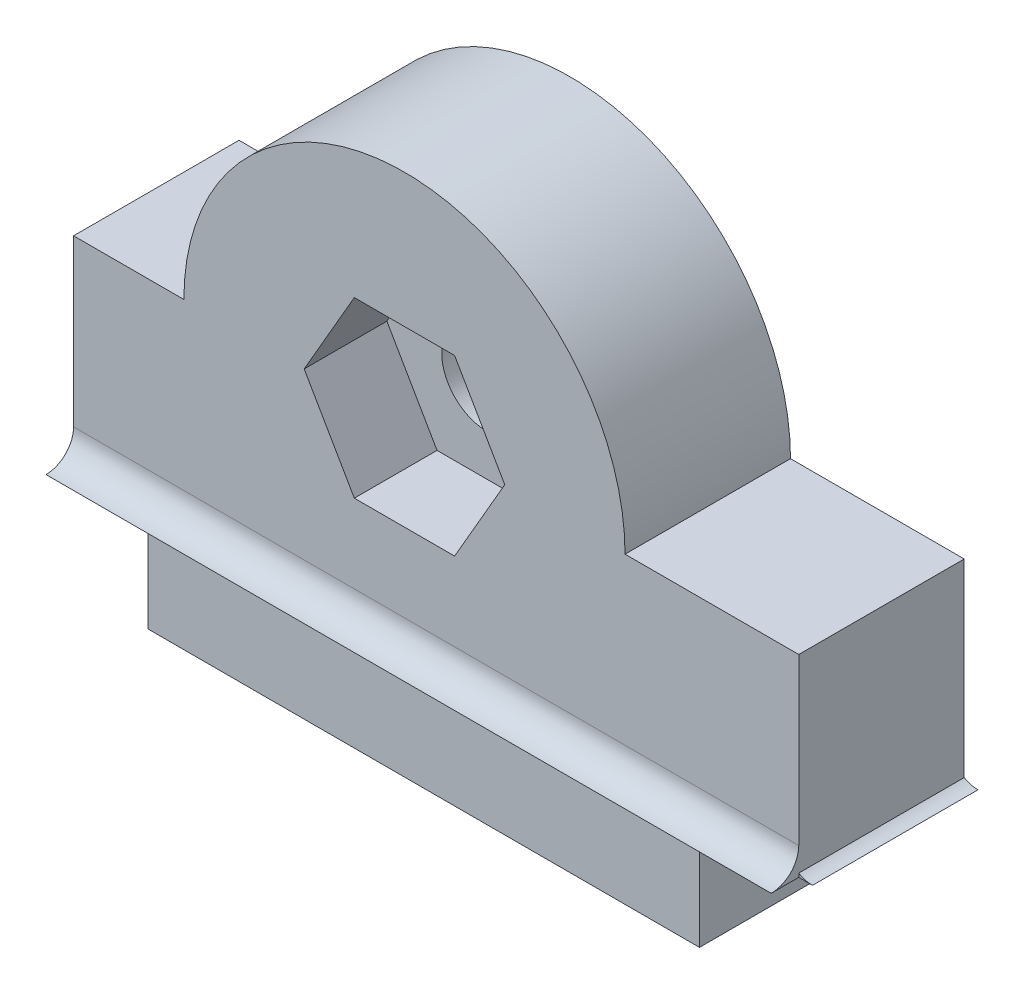
ISO-10303-21;
HEADER;
FILE_DESCRIPTION(('STEP AP214'),'2;1');
FILE_NAME('part.step','',(''),(''),'','','');
FILE_SCHEMA(('AUTOMOTIVE_DESIGN { 1 0 10303 214 1 1 1 1 }'));
ENDSEC;
DATA;
#1=APPLICATION_CONTEXT('core data for automotive mechanical design processes');
#2=APPLICATION_PROTOCOL_DEFINITION('international standard','automotive_design',2000,#1);
#3=PRODUCT_CONTEXT('',#1,'mechanical');
#4=PRODUCT('Part','Part','',(#3));
#5=PRODUCT_RELATED_PRODUCT_CATEGORY('part','',(#4));
#6=PRODUCT_DEFINITION_FORMATION('','',#4);
#7=PRODUCT_DEFINITION_CONTEXT('part definition',#1,'design');
#8=PRODUCT_DEFINITION('design','',#6,#7);
#9=PRODUCT_DEFINITION_SHAPE('','',#8);
#10=(LENGTH_UNIT() NAMED_UNIT(*) SI_UNIT(.MILLI.,.METRE.));
#11=(NAMED_UNIT(*) PLANE_ANGLE_UNIT() SI_UNIT($,.RADIAN.));
#12=(NAMED_UNIT(*) SI_UNIT($,.STERADIAN.) SOLID_ANGLE_UNIT());
#13=UNCERTAINTY_MEASURE_WITH_UNIT(LENGTH_MEASURE(1.E-05),#10,'distance_accuracy_value','');
#14=(GEOMETRIC_REPRESENTATION_CONTEXT(3) GLOBAL_UNCERTAINTY_ASSIGNED_CONTEXT((#13)) GLOBAL_UNIT_ASSIGNED_CONTEXT((#10,
#11,#12)) REPRESENTATION_CONTEXT('',''));
#15=CARTESIAN_POINT('',(0.,0.,0.));
#16=DIRECTION('',(0.,0.,1.));
#17=DIRECTION('',(1.,0.,0.));
#18=AXIS2_PLACEMENT_3D('',#15,#16,#17);
#19=CARTESIAN_POINT('',(9.29999999999998,11.,6.));
#20=DIRECTION('',(0.,0.,1.));
#21=DIRECTION('',(1.,0.,0.));
#22=AXIS2_PLACEMENT_3D('',#19,#20,#21);
#23=PLANE('',#22);
#24=DIRECTION('',(-1.,0.,0.));
#25=VECTOR('',#24,1.);
#26=CARTESIAN_POINT('',(11.1186533479473,14.15,6.));
#27=LINE('',#26,#25);
#28=CARTESIAN_POINT('',(11.1186533479473,14.15,6.));
#29=VERTEX_POINT('',#28);
#30=CARTESIAN_POINT('',(7.48134665205268,14.15,6.));
#31=VERTEX_POINT('',#30);
#32=EDGE_CURVE('E237',#29,#31,#27,.T.);
#33=ORIENTED_EDGE('',*,*,#32,.F.);
#34=DIRECTION('',(-0.5,0.866025403784439,0.));
#35=VECTOR('',#34,1.);
#36=CARTESIAN_POINT('',(12.9373066958946,11.,6.));
#37=LINE('',#36,#35);
#38=CARTESIAN_POINT('',(12.9373066958946,11.,6.));
#39=VERTEX_POINT('',#38);
#40=EDGE_CURVE('E235',#39,#29,#37,.T.);
#41=ORIENTED_EDGE('',*,*,#40,.F.);
#42=DIRECTION('',(0.5,0.866025403784439,0.));
#43=VECTOR('',#42,1.);
#44=CARTESIAN_POINT('',(11.1186533479473,7.85000000000001,6.));
#45=LINE('',#44,#43);
#46=CARTESIAN_POINT('',(11.1186533479473,7.85000000000001,6.));
#47=VERTEX_POINT('',#46);
#48=EDGE_CURVE('E181',#47,#39,#45,.T.);
#49=ORIENTED_EDGE('',*,*,#48,.F.);
#50=DIRECTION('',(1.,0.,0.));
#51=VECTOR('',#50,1.);
#52=CARTESIAN_POINT('',(7.48134665205267,7.85000000000002,6.));
#53=LINE('',#52,#51);
#54=CARTESIAN_POINT('',(7.48134665205267,7.85000000000002,6.));
#55=VERTEX_POINT('',#54);
#56=EDGE_CURVE('E243',#55,#47,#53,.T.);
#57=ORIENTED_EDGE('',*,*,#56,.F.);
#58=DIRECTION('',(0.5,-0.866025403784439,0.));
#59=VECTOR('',#58,1.);
#60=CARTESIAN_POINT('',(5.66269330410536,11.,6.));
#61=LINE('',#60,#59);
#62=CARTESIAN_POINT('',(5.66269330410536,11.,6.));
#63=VERTEX_POINT('',#62);
#64=EDGE_CURVE('E241',#63,#55,#61,.T.);
#65=ORIENTED_EDGE('',*,*,#64,.F.);
#66=DIRECTION('',(-0.5,-0.866025403784439,0.));
#67=VECTOR('',#66,1.);
#68=CARTESIAN_POINT('',(7.48134665205268,14.15,6.));
#69=LINE('',#68,#67);
#70=EDGE_CURVE('E239',#31,#63,#69,.T.);
#71=ORIENTED_EDGE('',*,*,#70,.F.);
#72=EDGE_LOOP('',(#33,#41,#49,#57,#65,#71));
#73=FACE_BOUND('',#72,.T.);
#74=DIRECTION('',(0.,-1.,0.));
#75=VECTOR('',#74,1.);
#76=CARTESIAN_POINT('',(-2.7,4.,6.));
#77=LINE('',#76,#75);
#78=CARTESIAN_POINT('',(-2.7,11.,6.));
#79=VERTEX_POINT('',#78);
#80=CARTESIAN_POINT('',(-2.7,5.,6.));
#81=VERTEX_POINT('',#80);
#82=EDGE_CURVE('E273',#79,#81,#77,.T.);
#83=ORIENTED_EDGE('',*,*,#82,.T.);
#84=DIRECTION('',(-1.,0.,0.));
#85=VECTOR('',#84,1.);
#86=CARTESIAN_POINT('',(25.0142135623731,5.,6.));
#87=LINE('',#86,#85);
#88=CARTESIAN_POINT('',(-1.49999999999999,5.,6.));
#89=VERTEX_POINT('',#88);
#90=EDGE_CURVE('E230',#89,#81,#87,.T.);
#91=ORIENTED_EDGE('',*,*,#90,.F.);
#92=CARTESIAN_POINT('',(23.1,5.,6.));
#93=VERTEX_POINT('',#92);
#94=EDGE_CURVE('E229',#93,#89,#87,.T.);
#95=ORIENTED_EDGE('',*,*,#94,.F.);
#96=CARTESIAN_POINT('',(23.6,5.,6.));
#97=VERTEX_POINT('',#96);
#98=EDGE_CURVE('E226',#97,#93,#87,.T.);
#99=ORIENTED_EDGE('',*,*,#98,.F.);
#100=DIRECTION('',(0.,1.,0.));
#101=VECTOR('',#100,1.);
#102=CARTESIAN_POINT('',(23.6,11.,6.));
#103=LINE('',#102,#101);
#104=CARTESIAN_POINT('',(23.6,11.,6.));
#105=VERTEX_POINT('',#104);
#106=EDGE_CURVE('E265',#97,#105,#103,.T.);
#107=ORIENTED_EDGE('',*,*,#106,.T.);
#108=DIRECTION('',(-1.,0.,0.));
#109=VECTOR('',#108,1.);
#110=CARTESIAN_POINT('',(17.3,11.,6.));
#111=LINE('',#110,#109);
#112=CARTESIAN_POINT('',(17.3,11.,6.));
#113=VERTEX_POINT('',#112);
#114=EDGE_CURVE('E267',#105,#113,#111,.T.);
#115=ORIENTED_EDGE('',*,*,#114,.T.);
#116=CARTESIAN_POINT('',(9.29999999999998,11.,6.));
#117=DIRECTION('',(0.,0.,1.));
#118=DIRECTION('',(1.,0.,0.));
#119=AXIS2_PLACEMENT_3D('',#116,#117,#118);
#120=CIRCLE('',#119,8.00000000000001);
#121=CARTESIAN_POINT('',(1.29999999999998,11.,6.));
#122=VERTEX_POINT('',#121);
#123=EDGE_CURVE('E269',#113,#122,#120,.T.);
#124=ORIENTED_EDGE('',*,*,#123,.T.);
#125=DIRECTION('',(-1.,0.,0.));
#126=VECTOR('',#125,1.);
#127=CARTESIAN_POINT('',(-2.7,11.,6.));
#128=LINE('',#127,#126);
#129=EDGE_CURVE('E271',#122,#79,#128,.T.);
#130=ORIENTED_EDGE('',*,*,#129,.T.);
#131=EDGE_LOOP('',(#83,#91,#95,#99,#107,#115,#124,#130));
#132=FACE_BOUND('',#131,.T.);
#133=ADVANCED_FACE('F35',(#73,#132),#23,.T.);
#134=DIRECTION('',(-1.,0.,0.));
#135=VECTOR('',#134,1.);
#136=CARTESIAN_POINT('',(25.0142135623731,4.,6.));
#137=LINE('',#136,#135);
#138=CARTESIAN_POINT('',(20.,4.,6.));
#139=VERTEX_POINT('',#138);
#140=CARTESIAN_POINT('',(0.,4.,6.));
#141=VERTEX_POINT('',#140);
#142=EDGE_CURVE('E222',#139,#141,#137,.T.);
#143=ORIENTED_EDGE('',*,*,#142,.T.);
#144=DIRECTION('',(0.,-1.,0.));
#145=VECTOR('',#144,1.);
#146=CARTESIAN_POINT('',(0.,0.,6.));
#147=LINE('',#146,#145);
#148=CARTESIAN_POINT('',(0.,0.,6.));
#149=VERTEX_POINT('',#148);
#150=EDGE_CURVE('E257',#141,#149,#147,.T.);
#151=ORIENTED_EDGE('',*,*,#150,.T.);
#152=DIRECTION('',(1.,0.,0.));
#153=VECTOR('',#152,1.);
#154=CARTESIAN_POINT('',(0.,0.,6.));
#155=LINE('',#154,#153);
#156=CARTESIAN_POINT('',(20.,0.,6.));
#157=VERTEX_POINT('',#156);
#158=EDGE_CURVE('E260',#149,#157,#155,.T.);
#159=ORIENTED_EDGE('',*,*,#158,.T.);
#160=DIRECTION('',(0.,1.,0.));
#161=VECTOR('',#160,1.);
#162=CARTESIAN_POINT('',(20.,0.,6.));
#163=LINE('',#162,#161);
#164=EDGE_CURVE('E263',#157,#139,#163,.T.);
#165=ORIENTED_EDGE('',*,*,#164,.T.);
#166=EDGE_LOOP('',(#143,#151,#159,#165));
#167=FACE_BOUND('',#166,.T.);
#168=ADVANCED_FACE('F339',(#167),#23,.T.);
#169=CARTESIAN_POINT('',(9.29999999999998,11.,0.));
#170=DIRECTION('',(0.,0.,1.));
#171=DIRECTION('',(1.,0.,0.));
#172=AXIS2_PLACEMENT_3D('',#169,#170,#171);
#173=PLANE('',#172);
#174=DIRECTION('',(0.,-1.,0.));
#175=VECTOR('',#174,1.);
#176=CARTESIAN_POINT('',(0.,0.,0.));
#177=LINE('',#176,#175);
#178=CARTESIAN_POINT('',(0.,4.,0.));
#179=VERTEX_POINT('',#178);
#180=CARTESIAN_POINT('',(0.,0.,0.));
#181=VERTEX_POINT('',#180);
#182=EDGE_CURVE('E256',#179,#181,#177,.T.);
#183=ORIENTED_EDGE('',*,*,#182,.F.);
#184=DIRECTION('',(1.,0.,0.));
#185=VECTOR('',#184,1.);
#186=CARTESIAN_POINT('',(0.,4.,0.));
#187=LINE('',#186,#185);
#188=CARTESIAN_POINT('',(-2.7,4.,0.));
#189=VERTEX_POINT('',#188);
#190=EDGE_CURVE('E261',#189,#179,#187,.T.);
#191=ORIENTED_EDGE('',*,*,#190,.F.);
#192=DIRECTION('',(0.,-1.,0.));
#193=VECTOR('',#192,1.);
#194=CARTESIAN_POINT('',(-2.7,4.,0.));
#195=LINE('',#194,#193);
#196=CARTESIAN_POINT('',(-2.7,11.,0.));
#197=VERTEX_POINT('',#196);
#198=EDGE_CURVE('E293',#197,#189,#195,.T.);
#199=ORIENTED_EDGE('',*,*,#198,.F.);
#200=DIRECTION('',(-1.,0.,0.));
#201=VECTOR('',#200,1.);
#202=CARTESIAN_POINT('',(-2.7,11.,0.));
#203=LINE('',#202,#201);
#204=CARTESIAN_POINT('',(1.29999999999998,11.,0.));
#205=VERTEX_POINT('',#204);
#206=EDGE_CURVE('E291',#205,#197,#203,.T.);
#207=ORIENTED_EDGE('',*,*,#206,.F.);
#208=CARTESIAN_POINT('',(9.29999999999998,11.,0.));
#209=DIRECTION('',(0.,0.,1.));
#210=DIRECTION('',(1.,0.,0.));
#211=AXIS2_PLACEMENT_3D('',#208,#209,#210);
#212=CIRCLE('',#211,8.00000000000001);
#213=CARTESIAN_POINT('',(17.3,11.,0.));
#214=VERTEX_POINT('',#213);
#215=EDGE_CURVE('E289',#214,#205,#212,.T.);
#216=ORIENTED_EDGE('',*,*,#215,.F.);
#217=DIRECTION('',(-1.,0.,0.));
#218=VECTOR('',#217,1.);
#219=CARTESIAN_POINT('',(17.3,11.,0.));
#220=LINE('',#219,#218);
#221=CARTESIAN_POINT('',(23.6,11.,0.));
#222=VERTEX_POINT('',#221);
#223=EDGE_CURVE('E287',#222,#214,#220,.T.);
#224=ORIENTED_EDGE('',*,*,#223,.F.);
#225=DIRECTION('',(0.,1.,0.));
#226=VECTOR('',#225,1.);
#227=CARTESIAN_POINT('',(23.6,11.,0.));
#228=LINE('',#227,#226);
#229=CARTESIAN_POINT('',(23.6,4.13397459621556,0.));
#230=VERTEX_POINT('',#229);
#231=EDGE_CURVE('E285',#230,#222,#228,.T.);
#232=ORIENTED_EDGE('',*,*,#231,.F.);
#233=CARTESIAN_POINT('',(24.1,5.,0.));
#234=DIRECTION('',(0.,0.,1.));
#235=DIRECTION('',(1.,0.,0.));
#236=AXIS2_PLACEMENT_3D('',#233,#234,#235);
#237=CIRCLE('',#236,1.);
#238=CARTESIAN_POINT('',(24.1,4.,0.));
#239=VERTEX_POINT('',#238);
#240=EDGE_CURVE('E210',#230,#239,#237,.T.);
#241=ORIENTED_EDGE('',*,*,#240,.T.);
#242=DIRECTION('',(1.,0.,0.));
#243=VECTOR('',#242,1.);
#244=CARTESIAN_POINT('',(23.6,4.,0.));
#245=LINE('',#244,#243);
#246=CARTESIAN_POINT('',(20.,4.,0.));
#247=VERTEX_POINT('',#246);
#248=EDGE_CURVE('E283',#247,#239,#245,.T.);
#249=ORIENTED_EDGE('',*,*,#248,.F.);
#250=DIRECTION('',(0.,1.,0.));
#251=VECTOR('',#250,1.);
#252=CARTESIAN_POINT('',(20.,0.,0.));
#253=LINE('',#252,#251);
#254=CARTESIAN_POINT('',(20.,0.,0.));
#255=VERTEX_POINT('',#254);
#256=EDGE_CURVE('E281',#255,#247,#253,.T.);
#257=ORIENTED_EDGE('',*,*,#256,.F.);
#258=DIRECTION('',(1.,0.,0.));
#259=VECTOR('',#258,1.);
#260=CARTESIAN_POINT('',(0.,0.,0.));
#261=LINE('',#260,#259);
#262=EDGE_CURVE('E279',#181,#255,#261,.T.);
#263=ORIENTED_EDGE('',*,*,#262,.F.);
#264=EDGE_LOOP('',(#183,#191,#199,#207,#216,#224,#232,#241,#249,#257,#263));
#265=FACE_BOUND('',#264,.T.);
#266=CARTESIAN_POINT('',(9.29999999999998,11.,0.));
#267=DIRECTION('',(0.,0.,1.));
#268=DIRECTION('',(1.,0.,0.));
#269=AXIS2_PLACEMENT_3D('',#266,#267,#268);
#270=CIRCLE('',#269,1.65);
#271=CARTESIAN_POINT('',(10.95,11.,0.));
#272=VERTEX_POINT('',#271);
#273=EDGE_CURVE('E596',#272,#272,#270,.T.);
#274=ORIENTED_EDGE('',*,*,#273,.T.);
#275=EDGE_LOOP('',(#274));
#276=FACE_BOUND('',#275,.T.);
#277=ADVANCED_FACE('F328',(#265,#276),#173,.F.);
#278=CARTESIAN_POINT('',(0.,0.,6.));
#279=DIRECTION('',(1.,0.,0.));
#280=DIRECTION('',(0.,0.,-1.));
#281=AXIS2_PLACEMENT_3D('',#278,#279,#280);
#282=PLANE('',#281);
#283=ORIENTED_EDGE('',*,*,#182,.T.);
#284=DIRECTION('',(0.,0.,-1.));
#285=VECTOR('',#284,1.);
#286=CARTESIAN_POINT('',(0.,0.,6.));
#287=LINE('',#286,#285);
#288=EDGE_CURVE('E11',#149,#181,#287,.T.);
#289=ORIENTED_EDGE('',*,*,#288,.F.);
#290=ORIENTED_EDGE('',*,*,#150,.F.);
#291=DIRECTION('',(0.,0.,-1.));
#292=VECTOR('',#291,1.);
#293=CARTESIAN_POINT('',(0.,4.,6.));
#294=LINE('',#293,#292);
#295=EDGE_CURVE('E276',#141,#179,#294,.T.);
#296=ORIENTED_EDGE('',*,*,#295,.T.);
#297=EDGE_LOOP('',(#283,#289,#290,#296));
#298=FACE_BOUND('',#297,.T.);
#299=ADVANCED_FACE('F37',(#298),#282,.F.);
#300=CARTESIAN_POINT('',(0.,0.,6.));
#301=DIRECTION('',(0.,1.,0.));
#302=DIRECTION('',(0.,0.,1.));
#303=AXIS2_PLACEMENT_3D('',#300,#301,#302);
#304=PLANE('',#303);
#305=ORIENTED_EDGE('',*,*,#262,.T.);
#306=DIRECTION('',(0.,0.,-1.));
#307=VECTOR('',#306,1.);
#308=CARTESIAN_POINT('',(20.,0.,6.));
#309=LINE('',#308,#307);
#310=EDGE_CURVE('E43',#157,#255,#309,.T.);
#311=ORIENTED_EDGE('',*,*,#310,.F.);
#312=ORIENTED_EDGE('',*,*,#158,.F.);
#313=ORIENTED_EDGE('',*,*,#288,.T.);
#314=EDGE_LOOP('',(#305,#311,#312,#313));
#315=FACE_BOUND('',#314,.T.);
#316=ADVANCED_FACE('F341',(#315),#304,.F.);
#317=CARTESIAN_POINT('',(20.,0.,6.));
#318=DIRECTION('',(-1.,0.,0.));
#319=DIRECTION('',(0.,0.,1.));
#320=AXIS2_PLACEMENT_3D('',#317,#318,#319);
#321=PLANE('',#320);
#322=ORIENTED_EDGE('',*,*,#256,.T.);
#323=DIRECTION('',(0.,0.,-1.));
#324=VECTOR('',#323,1.);
#325=CARTESIAN_POINT('',(20.,4.,6.));
#326=LINE('',#325,#324);
#327=EDGE_CURVE('E315',#139,#247,#326,.T.);
#328=ORIENTED_EDGE('',*,*,#327,.F.);
#329=ORIENTED_EDGE('',*,*,#164,.F.);
#330=ORIENTED_EDGE('',*,*,#310,.T.);
#331=EDGE_LOOP('',(#322,#328,#329,#330));
#332=FACE_BOUND('',#331,.T.);
#333=ADVANCED_FACE('F322',(#332),#321,.F.);
#334=CARTESIAN_POINT('',(23.6,11.,6.));
#335=DIRECTION('',(-1.,0.,0.));
#336=DIRECTION('',(0.,-1.,0.));
#337=AXIS2_PLACEMENT_3D('',#334,#335,#336);
#338=PLANE('',#337);
#339=DIRECTION('',(0.,1.,0.));
#340=VECTOR('',#339,1.);
#341=CARTESIAN_POINT('',(23.6,11.,6.));
#342=LINE('',#341,#340);
#343=CARTESIAN_POINT('',(23.6,4.,6.));
#344=VERTEX_POINT('',#343);
#345=CARTESIAN_POINT('',(23.6,4.13397459621556,6.));
#346=VERTEX_POINT('',#345);
#347=EDGE_CURVE('E213',#344,#346,#342,.T.);
#348=ORIENTED_EDGE('',*,*,#347,.T.);
#349=DIRECTION('',(0.,0.,1.));
#350=VECTOR('',#349,1.);
#351=CARTESIAN_POINT('',(23.6,4.13397459621556,-1.4142135623731));
#352=LINE('',#351,#350);
#353=EDGE_CURVE('E215',#346,#230,#352,.F.);
#354=ORIENTED_EDGE('',*,*,#353,.T.);
#355=ORIENTED_EDGE('',*,*,#231,.T.);
#356=DIRECTION('',(0.,0.,-1.));
#357=VECTOR('',#356,1.);
#358=CARTESIAN_POINT('',(23.6,11.,6.));
#359=LINE('',#358,#357);
#360=EDGE_CURVE('E310',#105,#222,#359,.T.);
#361=ORIENTED_EDGE('',*,*,#360,.F.);
#362=ORIENTED_EDGE('',*,*,#106,.F.);
#363=CARTESIAN_POINT('',(23.6,5.,7.));
#364=DIRECTION('',(-1.,0.,0.));
#365=DIRECTION('',(0.,-1.,0.));
#366=AXIS2_PLACEMENT_3D('',#363,#364,#365);
#367=CIRCLE('',#366,1.);
#368=CARTESIAN_POINT('',(23.6,4.,7.));
#369=VERTEX_POINT('',#368);
#370=EDGE_CURVE('E225',#97,#369,#367,.T.);
#371=ORIENTED_EDGE('',*,*,#370,.T.);
#372=DIRECTION('',(0.,0.,-1.));
#373=VECTOR('',#372,1.);
#374=CARTESIAN_POINT('',(23.6,4.,6.));
#375=LINE('',#374,#373);
#376=EDGE_CURVE('E313',#369,#344,#375,.T.);
#377=ORIENTED_EDGE('',*,*,#376,.T.);
#378=EDGE_LOOP('',(#348,#354,#355,#361,#362,#371,#377));
#379=FACE_BOUND('',#378,.T.);
#380=ADVANCED_FACE('F368',(#379),#338,.F.);
#381=CARTESIAN_POINT('',(17.3,11.,6.));
#382=DIRECTION('',(0.,-1.,0.));
#383=DIRECTION('',(0.,0.,-1.));
#384=AXIS2_PLACEMENT_3D('',#381,#382,#383);
#385=PLANE('',#384);
#386=ORIENTED_EDGE('',*,*,#223,.T.);
#387=DIRECTION('',(0.,0.,-1.));
#388=VECTOR('',#387,1.);
#389=CARTESIAN_POINT('',(17.3,11.,6.));
#390=LINE('',#389,#388);
#391=EDGE_CURVE('E307',#113,#214,#390,.T.);
#392=ORIENTED_EDGE('',*,*,#391,.F.);
#393=ORIENTED_EDGE('',*,*,#114,.F.);
#394=ORIENTED_EDGE('',*,*,#360,.T.);
#395=EDGE_LOOP('',(#386,#392,#393,#394));
#396=FACE_BOUND('',#395,.T.);
#397=ADVANCED_FACE('F364',(#396),#385,.F.);
#398=CARTESIAN_POINT('',(9.29999999999998,11.,6.));
#399=DIRECTION('',(0.,0.,-1.));
#400=DIRECTION('',(-1.,0.,0.));
#401=AXIS2_PLACEMENT_3D('',#398,#399,#400);
#402=CYLINDRICAL_SURFACE('',#401,8.00000000000001);
#403=ORIENTED_EDGE('',*,*,#215,.T.);
#404=DIRECTION('',(0.,0.,-1.));
#405=VECTOR('',#404,1.);
#406=CARTESIAN_POINT('',(1.29999999999998,11.,6.));
#407=LINE('',#406,#405);
#408=EDGE_CURVE('E304',#122,#205,#407,.T.);
#409=ORIENTED_EDGE('',*,*,#408,.F.);
#410=ORIENTED_EDGE('',*,*,#123,.F.);
#411=ORIENTED_EDGE('',*,*,#391,.T.);
#412=EDGE_LOOP('',(#403,#409,#410,#411));
#413=FACE_BOUND('',#412,.T.);
#414=ADVANCED_FACE('F359',(#413),#402,.T.);
#415=CARTESIAN_POINT('',(-2.7,11.,6.));
#416=DIRECTION('',(0.,-1.,0.));
#417=DIRECTION('',(0.,0.,-1.));
#418=AXIS2_PLACEMENT_3D('',#415,#416,#417);
#419=PLANE('',#418);
#420=ORIENTED_EDGE('',*,*,#206,.T.);
#421=DIRECTION('',(0.,0.,-1.));
#422=VECTOR('',#421,1.);
#423=CARTESIAN_POINT('',(-2.7,11.,6.));
#424=LINE('',#423,#422);
#425=EDGE_CURVE('E301',#79,#197,#424,.T.);
#426=ORIENTED_EDGE('',*,*,#425,.F.);
#427=ORIENTED_EDGE('',*,*,#129,.F.);
#428=ORIENTED_EDGE('',*,*,#408,.T.);
#429=EDGE_LOOP('',(#420,#426,#427,#428));
#430=FACE_BOUND('',#429,.T.);
#431=ADVANCED_FACE('F354',(#430),#419,.F.);
#432=CARTESIAN_POINT('',(-2.7,4.,6.));
#433=DIRECTION('',(1.,0.,0.));
#434=DIRECTION('',(0.,1.,0.));
#435=AXIS2_PLACEMENT_3D('',#432,#433,#434);
#436=PLANE('',#435);
#437=ORIENTED_EDGE('',*,*,#198,.T.);
#438=DIRECTION('',(0.,0.,-1.));
#439=VECTOR('',#438,1.);
#440=CARTESIAN_POINT('',(-2.7,4.,6.));
#441=LINE('',#440,#439);
#442=CARTESIAN_POINT('',(-2.7,4.,7.));
#443=VERTEX_POINT('',#442);
#444=EDGE_CURVE('E298',#443,#189,#441,.T.);
#445=ORIENTED_EDGE('',*,*,#444,.F.);
#446=CARTESIAN_POINT('',(-2.7,5.,7.));
#447=DIRECTION('',(1.,0.,0.));
#448=DIRECTION('',(0.,0.,1.));
#449=AXIS2_PLACEMENT_3D('',#446,#447,#448);
#450=CIRCLE('',#449,1.);
#451=EDGE_CURVE('E218',#443,#81,#450,.T.);
#452=ORIENTED_EDGE('',*,*,#451,.T.);
#453=ORIENTED_EDGE('',*,*,#82,.F.);
#454=ORIENTED_EDGE('',*,*,#425,.T.);
#455=EDGE_LOOP('',(#437,#445,#452,#453,#454));
#456=FACE_BOUND('',#455,.T.);
#457=ADVANCED_FACE('F349',(#456),#436,.F.);
#458=CARTESIAN_POINT('',(0.,4.,6.));
#459=DIRECTION('',(0.,1.,0.));
#460=DIRECTION('',(0.,0.,1.));
#461=AXIS2_PLACEMENT_3D('',#458,#459,#460);
#462=PLANE('',#461);
#463=ORIENTED_EDGE('',*,*,#190,.T.);
#464=ORIENTED_EDGE('',*,*,#295,.F.);
#465=ORIENTED_EDGE('',*,*,#142,.F.);
#466=ORIENTED_EDGE('',*,*,#327,.T.);
#467=ORIENTED_EDGE('',*,*,#248,.T.);
#468=DIRECTION('',(0.,0.,1.));
#469=VECTOR('',#468,1.);
#470=CARTESIAN_POINT('',(24.1,4.,-1.4142135623731));
#471=LINE('',#470,#469);
#472=CARTESIAN_POINT('',(24.1,4.,6.));
#473=VERTEX_POINT('',#472);
#474=EDGE_CURVE('E207',#239,#473,#471,.T.);
#475=ORIENTED_EDGE('',*,*,#474,.T.);
#476=DIRECTION('',(1.,0.,0.));
#477=VECTOR('',#476,1.);
#478=CARTESIAN_POINT('',(23.1,4.,6.));
#479=LINE('',#478,#477);
#480=EDGE_CURVE('E191',#344,#473,#479,.T.);
#481=ORIENTED_EDGE('',*,*,#480,.F.);
#482=ORIENTED_EDGE('',*,*,#376,.F.);
#483=DIRECTION('',(-1.,0.,0.));
#484=VECTOR('',#483,1.);
#485=CARTESIAN_POINT('',(25.0142135623731,4.,7.));
#486=LINE('',#485,#484);
#487=EDGE_CURVE('E221',#369,#443,#486,.T.);
#488=ORIENTED_EDGE('',*,*,#487,.T.);
#489=ORIENTED_EDGE('',*,*,#444,.T.);
#490=EDGE_LOOP('',(#463,#464,#465,#466,#467,#475,#481,#482,#488,#489));
#491=FACE_BOUND('',#490,.T.);
#492=ADVANCED_FACE('F333',(#491),#462,.F.);
#493=CARTESIAN_POINT('',(12.9373066958946,11.,6.));
#494=DIRECTION('',(-0.866025403784439,-0.5,0.));
#495=DIRECTION('',(0.5,-0.866025403784439,0.));
#496=AXIS2_PLACEMENT_3D('',#493,#494,#495);
#497=PLANE('',#496);
#498=DIRECTION('',(-0.5,0.866025403784439,0.));
#499=VECTOR('',#498,1.);
#500=CARTESIAN_POINT('',(12.9373066958946,11.,3.));
#501=LINE('',#500,#499);
#502=CARTESIAN_POINT('',(12.9373066958946,11.,3.));
#503=VERTEX_POINT('',#502);
#504=CARTESIAN_POINT('',(11.1186533479473,14.15,3.));
#505=VERTEX_POINT('',#504);
#506=EDGE_CURVE('E187',#503,#505,#501,.T.);
#507=ORIENTED_EDGE('',*,*,#506,.F.);
#508=DIRECTION('',(0.,0.,-1.));
#509=VECTOR('',#508,1.);
#510=CARTESIAN_POINT('',(12.9373066958946,11.,6.));
#511=LINE('',#510,#509);
#512=EDGE_CURVE('E174',#39,#503,#511,.T.);
#513=ORIENTED_EDGE('',*,*,#512,.F.);
#514=ORIENTED_EDGE('',*,*,#40,.T.);
#515=DIRECTION('',(0.,0.,-1.));
#516=VECTOR('',#515,1.);
#517=CARTESIAN_POINT('',(11.1186533479473,14.15,6.));
#518=LINE('',#517,#516);
#519=EDGE_CURVE('E189',#29,#505,#518,.T.);
#520=ORIENTED_EDGE('',*,*,#519,.T.);
#521=EDGE_LOOP('',(#507,#513,#514,#520));
#522=FACE_BOUND('',#521,.T.);
#523=ADVANCED_FACE('F188',(#522),#497,.T.);
#524=CARTESIAN_POINT('',(11.1186533479473,14.15,6.));
#525=DIRECTION('',(0.,-1.,0.));
#526=DIRECTION('',(1.,0.,0.));
#527=AXIS2_PLACEMENT_3D('',#524,#525,#526);
#528=PLANE('',#527);
#529=DIRECTION('',(-1.,0.,0.));
#530=VECTOR('',#529,1.);
#531=CARTESIAN_POINT('',(11.1186533479473,14.15,3.));
#532=LINE('',#531,#530);
#533=CARTESIAN_POINT('',(7.48134665205268,14.15,3.));
#534=VERTEX_POINT('',#533);
#535=EDGE_CURVE('E50',#505,#534,#532,.T.);
#536=ORIENTED_EDGE('',*,*,#535,.F.);
#537=ORIENTED_EDGE('',*,*,#519,.F.);
#538=ORIENTED_EDGE('',*,*,#32,.T.);
#539=DIRECTION('',(0.,0.,-1.));
#540=VECTOR('',#539,1.);
#541=CARTESIAN_POINT('',(7.48134665205268,14.15,6.));
#542=LINE('',#541,#540);
#543=EDGE_CURVE('E253',#31,#534,#542,.T.);
#544=ORIENTED_EDGE('',*,*,#543,.T.);
#545=EDGE_LOOP('',(#536,#537,#538,#544));
#546=FACE_BOUND('',#545,.T.);
#547=ADVANCED_FACE('F545',(#546),#528,.T.);
#548=CARTESIAN_POINT('',(7.48134665205268,14.15,6.));
#549=DIRECTION('',(0.866025403784439,-0.5,0.));
#550=DIRECTION('',(0.5,0.866025403784439,0.));
#551=AXIS2_PLACEMENT_3D('',#548,#549,#550);
#552=PLANE('',#551);
#553=DIRECTION('',(-0.5,-0.866025403784439,0.));
#554=VECTOR('',#553,1.);
#555=CARTESIAN_POINT('',(7.48134665205266,14.15,3.));
#556=LINE('',#555,#554);
#557=CARTESIAN_POINT('',(5.66269330410536,11.,3.));
#558=VERTEX_POINT('',#557);
#559=EDGE_CURVE('E58',#534,#558,#556,.T.);
#560=ORIENTED_EDGE('',*,*,#559,.F.);
#561=ORIENTED_EDGE('',*,*,#543,.F.);
#562=ORIENTED_EDGE('',*,*,#70,.T.);
#563=DIRECTION('',(0.,0.,-1.));
#564=VECTOR('',#563,1.);
#565=CARTESIAN_POINT('',(5.66269330410536,11.,6.));
#566=LINE('',#565,#564);
#567=EDGE_CURVE('E251',#63,#558,#566,.T.);
#568=ORIENTED_EDGE('',*,*,#567,.T.);
#569=EDGE_LOOP('',(#560,#561,#562,#568));
#570=FACE_BOUND('',#569,.T.);
#571=ADVANCED_FACE('F552',(#570),#552,.T.);
#572=CARTESIAN_POINT('',(5.66269330410536,11.,6.));
#573=DIRECTION('',(0.866025403784438,0.5,0.));
#574=DIRECTION('',(-0.5,0.866025403784439,0.));
#575=AXIS2_PLACEMENT_3D('',#572,#573,#574);
#576=PLANE('',#575);
#577=DIRECTION('',(0.5,-0.866025403784439,0.));
#578=VECTOR('',#577,1.);
#579=CARTESIAN_POINT('',(5.66269330410534,11.,3.));
#580=LINE('',#579,#578);
#581=CARTESIAN_POINT('',(7.48134665205267,7.85000000000002,3.));
#582=VERTEX_POINT('',#581);
#583=EDGE_CURVE('E199',#558,#582,#580,.T.);
#584=ORIENTED_EDGE('',*,*,#583,.F.);
#585=ORIENTED_EDGE('',*,*,#567,.F.);
#586=ORIENTED_EDGE('',*,*,#64,.T.);
#587=DIRECTION('',(0.,0.,-1.));
#588=VECTOR('',#587,1.);
#589=CARTESIAN_POINT('',(7.48134665205267,7.85000000000002,6.));
#590=LINE('',#589,#588);
#591=EDGE_CURVE('E248',#55,#582,#590,.T.);
#592=ORIENTED_EDGE('',*,*,#591,.T.);
#593=EDGE_LOOP('',(#584,#585,#586,#592));
#594=FACE_BOUND('',#593,.T.);
#595=ADVANCED_FACE('F559',(#594),#576,.T.);
#596=CARTESIAN_POINT('',(7.48134665205267,7.85000000000002,6.));
#597=DIRECTION('',(0.,1.,0.));
#598=DIRECTION('',(-1.,0.,0.));
#599=AXIS2_PLACEMENT_3D('',#596,#597,#598);
#600=PLANE('',#599);
#601=DIRECTION('',(1.,0.,0.));
#602=VECTOR('',#601,1.);
#603=CARTESIAN_POINT('',(7.48134665205266,7.85,3.));
#604=LINE('',#603,#602);
#605=CARTESIAN_POINT('',(11.1186533479473,7.85000000000001,3.));
#606=VERTEX_POINT('',#605);
#607=EDGE_CURVE('E197',#582,#606,#604,.T.);
#608=ORIENTED_EDGE('',*,*,#607,.F.);
#609=ORIENTED_EDGE('',*,*,#591,.F.);
#610=ORIENTED_EDGE('',*,*,#56,.T.);
#611=DIRECTION('',(0.,0.,-1.));
#612=VECTOR('',#611,1.);
#613=CARTESIAN_POINT('',(11.1186533479473,7.85000000000001,6.));
#614=LINE('',#613,#612);
#615=EDGE_CURVE('E184',#47,#606,#614,.T.);
#616=ORIENTED_EDGE('',*,*,#615,.T.);
#617=EDGE_LOOP('',(#608,#609,#610,#616));
#618=FACE_BOUND('',#617,.T.);
#619=ADVANCED_FACE('F567',(#618),#600,.T.);
#620=CARTESIAN_POINT('',(11.1186533479473,7.85000000000001,6.));
#621=DIRECTION('',(-0.866025403784439,0.5,0.));
#622=DIRECTION('',(-0.5,-0.866025403784439,0.));
#623=AXIS2_PLACEMENT_3D('',#620,#621,#622);
#624=PLANE('',#623);
#625=DIRECTION('',(0.5,0.866025403784439,0.));
#626=VECTOR('',#625,1.);
#627=CARTESIAN_POINT('',(11.1186533479473,7.85,3.));
#628=LINE('',#627,#626);
#629=EDGE_CURVE('E178',#606,#503,#628,.T.);
#630=ORIENTED_EDGE('',*,*,#629,.F.);
#631=ORIENTED_EDGE('',*,*,#615,.F.);
#632=ORIENTED_EDGE('',*,*,#48,.T.);
#633=ORIENTED_EDGE('',*,*,#512,.T.);
#634=EDGE_LOOP('',(#630,#631,#632,#633));
#635=FACE_BOUND('',#634,.T.);
#636=ADVANCED_FACE('F176',(#635),#624,.T.);
#637=CARTESIAN_POINT('',(25.0142135623731,5.,7.));
#638=DIRECTION('',(-1.,0.,0.));
#639=DIRECTION('',(0.,0.,1.));
#640=AXIS2_PLACEMENT_3D('',#637,#638,#639);
#641=CYLINDRICAL_SURFACE('',#640,1.);
#642=ORIENTED_EDGE('',*,*,#370,.F.);
#643=ORIENTED_EDGE('',*,*,#98,.T.);
#644=ORIENTED_EDGE('',*,*,#94,.T.);
#645=ORIENTED_EDGE('',*,*,#90,.T.);
#646=ORIENTED_EDGE('',*,*,#451,.F.);
#647=ORIENTED_EDGE('',*,*,#487,.F.);
#648=EDGE_LOOP('',(#642,#643,#644,#645,#646,#647));
#649=FACE_BOUND('',#648,.T.);
#650=ADVANCED_FACE('F377',(#649),#641,.F.);
#651=CARTESIAN_POINT('',(24.1,5.,-1.4142135623731));
#652=DIRECTION('',(0.,0.,1.));
#653=DIRECTION('',(1.,0.,0.));
#654=AXIS2_PLACEMENT_3D('',#651,#652,#653);
#655=CYLINDRICAL_SURFACE('',#654,1.);
#656=ORIENTED_EDGE('',*,*,#353,.F.);
#657=CARTESIAN_POINT('',(24.1,5.,6.));
#658=DIRECTION('',(0.,0.,-1.));
#659=DIRECTION('',(1.,0.,0.));
#660=AXIS2_PLACEMENT_3D('',#657,#658,#659);
#661=CIRCLE('',#660,1.);
#662=EDGE_CURVE('E204',#473,#346,#661,.T.);
#663=ORIENTED_EDGE('',*,*,#662,.F.);
#664=ORIENTED_EDGE('',*,*,#474,.F.);
#665=ORIENTED_EDGE('',*,*,#240,.F.);
#666=EDGE_LOOP('',(#656,#663,#664,#665));
#667=FACE_BOUND('',#666,.T.);
#668=ADVANCED_FACE('F373',(#667),#655,.F.);
#669=CARTESIAN_POINT('',(24.1,5.,6.));
#670=DIRECTION('',(0.,0.,1.));
#671=DIRECTION('',(1.,0.,0.));
#672=AXIS2_PLACEMENT_3D('',#669,#670,#671);
#673=PLANE('',#672);
#674=ORIENTED_EDGE('',*,*,#347,.F.);
#675=ORIENTED_EDGE('',*,*,#480,.T.);
#676=ORIENTED_EDGE('',*,*,#662,.T.);
#677=EDGE_LOOP('',(#674,#675,#676));
#678=FACE_BOUND('',#677,.T.);
#679=ADVANCED_FACE('F375',(#678),#673,.T.);
#680=CARTESIAN_POINT('',(0.,0.,3.));
#681=DIRECTION('',(0.,0.,1.));
#682=DIRECTION('',(1.,0.,0.));
#683=AXIS2_PLACEMENT_3D('',#680,#681,#682);
#684=PLANE('',#683);
#685=ORIENTED_EDGE('',*,*,#535,.T.);
#686=ORIENTED_EDGE('',*,*,#559,.T.);
#687=ORIENTED_EDGE('',*,*,#583,.T.);
#688=ORIENTED_EDGE('',*,*,#607,.T.);
#689=ORIENTED_EDGE('',*,*,#629,.T.);
#690=ORIENTED_EDGE('',*,*,#506,.T.);
#691=EDGE_LOOP('',(#685,#686,#687,#688,#689,#690));
#692=FACE_BOUND('',#691,.T.);
#693=CARTESIAN_POINT('',(9.29999999999998,11.,3.));
#694=DIRECTION('',(0.,0.,1.));
#695=DIRECTION('',(1.,0.,0.));
#696=AXIS2_PLACEMENT_3D('',#693,#694,#695);
#697=CIRCLE('',#696,1.65);
#698=CARTESIAN_POINT('',(10.95,11.,3.));
#699=VERTEX_POINT('',#698);
#700=EDGE_CURVE('E595',#699,#699,#697,.T.);
#701=ORIENTED_EDGE('',*,*,#700,.F.);
#702=EDGE_LOOP('',(#701));
#703=FACE_BOUND('',#702,.T.);
#704=ADVANCED_FACE('F194',(#692,#703),#684,.T.);
#705=CARTESIAN_POINT('',(9.29999999999998,11.,3.));
#706=DIRECTION('',(0.,0.,-1.));
#707=DIRECTION('',(-1.,0.,0.));
#708=AXIS2_PLACEMENT_3D('',#705,#706,#707);
#709=CYLINDRICAL_SURFACE('',#708,1.65);
#710=ORIENTED_EDGE('',*,*,#700,.T.);
#711=EDGE_LOOP('',(#710));
#712=FACE_BOUND('',#711,.T.);
#713=ORIENTED_EDGE('',*,*,#273,.F.);
#714=EDGE_LOOP('',(#713));
#715=FACE_BOUND('',#714,.T.);
#716=ADVANCED_FACE('F494',(#712,#715),#709,.F.);
#717=CLOSED_SHELL('',(#133,#168,#277,#299,#316,#333,#380,#397,#414,#431,#457,#492,#523,#547,
#571,#595,#619,#636,#650,#668,#679,#704,#716));
#718=MANIFOLD_SOLID_BREP('B2',#717);
#719=ADVANCED_BREP_SHAPE_REPRESENTATION('',(#18,#718),#14);
#720=SHAPE_DEFINITION_REPRESENTATION(#9,#719);
ENDSEC;
END-ISO-10303-21;
